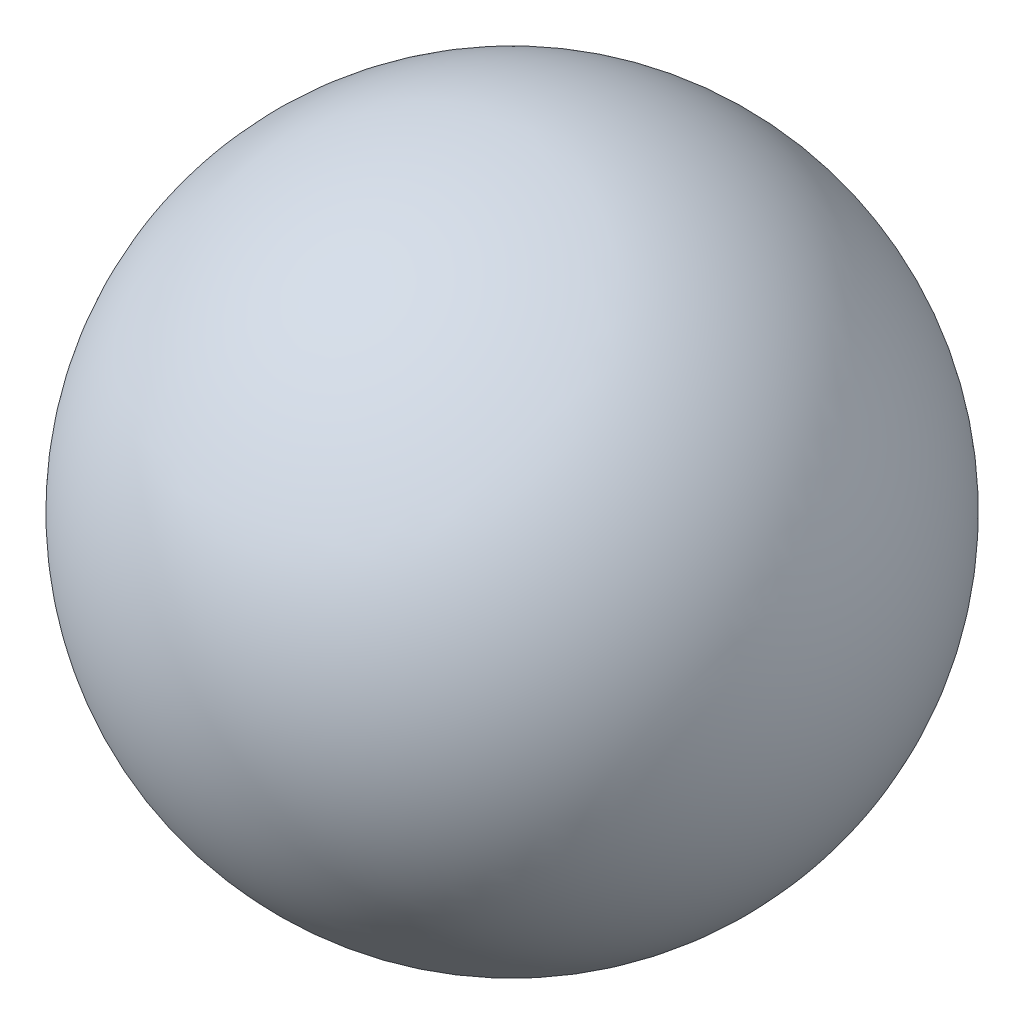
ISO-10303-21;
HEADER;
FILE_DESCRIPTION(('STEP AP214'),'2;1');
FILE_NAME('part.step','',(''),(''),'','','');
FILE_SCHEMA(('AUTOMOTIVE_DESIGN { 1 0 10303 214 1 1 1 1 }'));
ENDSEC;
DATA;
#1=APPLICATION_CONTEXT('core data for automotive mechanical design processes');
#2=APPLICATION_PROTOCOL_DEFINITION('international standard','automotive_design',2000,#1);
#3=PRODUCT_CONTEXT('',#1,'mechanical');
#4=PRODUCT('Part','Part','',(#3));
#5=PRODUCT_RELATED_PRODUCT_CATEGORY('part','',(#4));
#6=PRODUCT_DEFINITION_FORMATION('','',#4);
#7=PRODUCT_DEFINITION_CONTEXT('part definition',#1,'design');
#8=PRODUCT_DEFINITION('design','',#6,#7);
#9=PRODUCT_DEFINITION_SHAPE('','',#8);
#10=(LENGTH_UNIT() NAMED_UNIT(*) SI_UNIT(.MILLI.,.METRE.));
#11=(NAMED_UNIT(*) PLANE_ANGLE_UNIT() SI_UNIT($,.RADIAN.));
#12=(NAMED_UNIT(*) SI_UNIT($,.STERADIAN.) SOLID_ANGLE_UNIT());
#13=UNCERTAINTY_MEASURE_WITH_UNIT(LENGTH_MEASURE(1.E-05),#10,'distance_accuracy_value','');
#14=(GEOMETRIC_REPRESENTATION_CONTEXT(3) GLOBAL_UNCERTAINTY_ASSIGNED_CONTEXT((#13)) GLOBAL_UNIT_ASSIGNED_CONTEXT((#10,
#11,#12)) REPRESENTATION_CONTEXT('',''));
#15=CARTESIAN_POINT('',(0.,0.,0.));
#16=DIRECTION('',(0.,0.,1.));
#17=DIRECTION('',(1.,0.,0.));
#18=AXIS2_PLACEMENT_3D('',#15,#16,#17);
#19=CARTESIAN_POINT('',(-2.05212085995409,-5.63815572471604,2.));
#20=DIRECTION('',(-0.939692620785904,0.342020143325681,0.));
#21=DIRECTION('',(0.,0.,-1.));
#22=AXIS2_PLACEMENT_3D('',#19,#20,#21);
#23=SPHERICAL_SURFACE('',#22,1.04);
#24=CARTESIAN_POINT('',(-1.07484053433675,-5.99385667377475,2.));
#25=VERTEX_POINT('',#24);
#26=VERTEX_LOOP('',#25);
#27=FACE_BOUND('',#26,.T.);
#28=ADVANCED_FACE('F15',(#27),#23,.T.);
#29=CLOSED_SHELL('',(#28));
#30=MANIFOLD_SOLID_BREP('B1',#29);
#31=ADVANCED_BREP_SHAPE_REPRESENTATION('',(#18,#30),#14);
#32=SHAPE_DEFINITION_REPRESENTATION(#9,#31);
ENDSEC;
END-ISO-10303-21;
